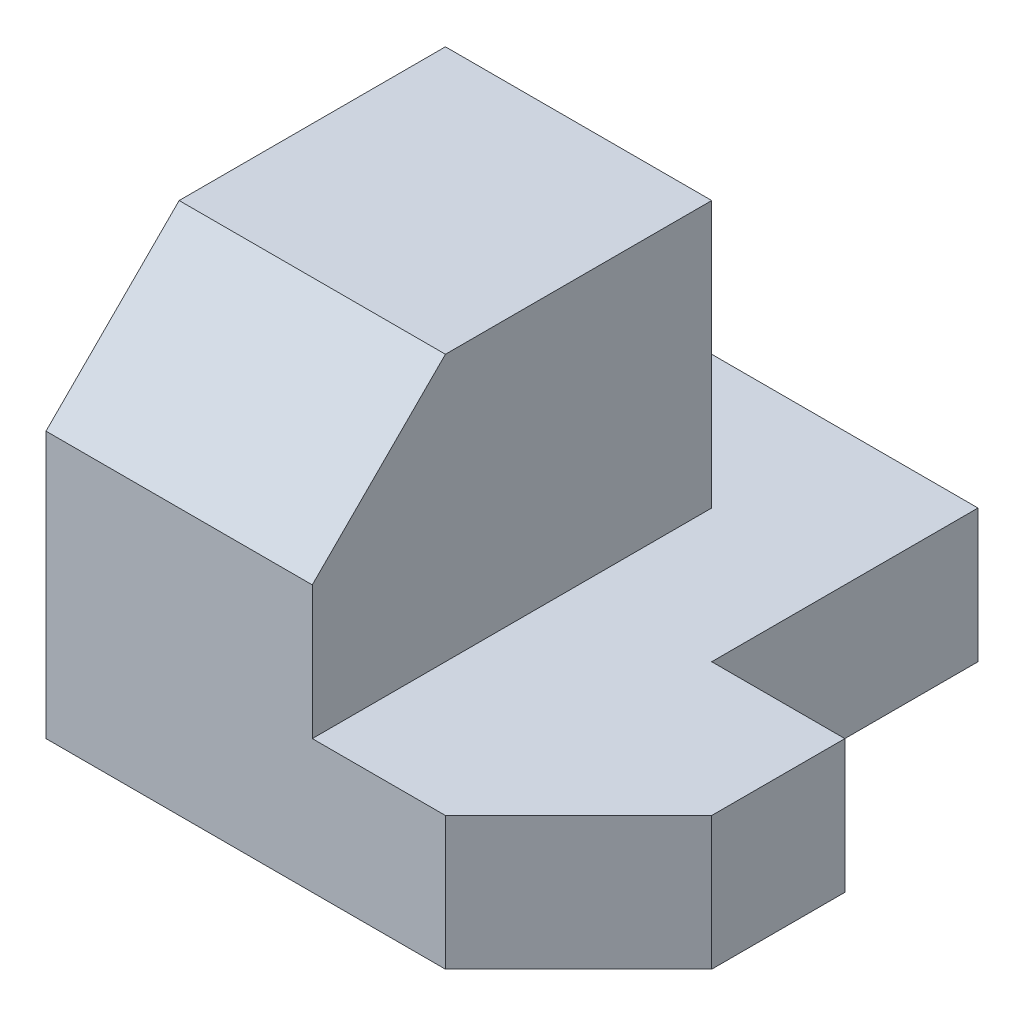
ISO-10303-21;
HEADER;
FILE_DESCRIPTION(('STEP AP214'),'2;1');
FILE_NAME('part.step','',(''),(''),'','','');
FILE_SCHEMA(('AUTOMOTIVE_DESIGN { 1 0 10303 214 1 1 1 1 }'));
ENDSEC;
DATA;
#1=APPLICATION_CONTEXT('core data for automotive mechanical design processes');
#2=APPLICATION_PROTOCOL_DEFINITION('international standard','automotive_design',2000,#1);
#3=PRODUCT_CONTEXT('',#1,'mechanical');
#4=PRODUCT('Part','Part','',(#3));
#5=PRODUCT_RELATED_PRODUCT_CATEGORY('part','',(#4));
#6=PRODUCT_DEFINITION_FORMATION('','',#4);
#7=PRODUCT_DEFINITION_CONTEXT('part definition',#1,'design');
#8=PRODUCT_DEFINITION('design','',#6,#7);
#9=PRODUCT_DEFINITION_SHAPE('','',#8);
#10=(LENGTH_UNIT() NAMED_UNIT(*) SI_UNIT(.MILLI.,.METRE.));
#11=(NAMED_UNIT(*) PLANE_ANGLE_UNIT() SI_UNIT($,.RADIAN.));
#12=(NAMED_UNIT(*) SI_UNIT($,.STERADIAN.) SOLID_ANGLE_UNIT());
#13=UNCERTAINTY_MEASURE_WITH_UNIT(LENGTH_MEASURE(1.E-05),#10,'distance_accuracy_value','');
#14=(GEOMETRIC_REPRESENTATION_CONTEXT(3) GLOBAL_UNCERTAINTY_ASSIGNED_CONTEXT((#13)) GLOBAL_UNIT_ASSIGNED_CONTEXT((#10,
#11,#12)) REPRESENTATION_CONTEXT('',''));
#15=CARTESIAN_POINT('',(0.,0.,0.));
#16=DIRECTION('',(0.,0.,1.));
#17=DIRECTION('',(1.,0.,0.));
#18=AXIS2_PLACEMENT_3D('',#15,#16,#17);
#19=CARTESIAN_POINT('',(0.,5.,0.));
#20=DIRECTION('',(-1.,0.,0.));
#21=DIRECTION('',(0.,0.,1.));
#22=AXIS2_PLACEMENT_3D('',#19,#20,#21);
#23=PLANE('',#22);
#24=DIRECTION('',(0.,-0.707106781186548,0.707106781186547));
#25=VECTOR('',#24,1.);
#26=CARTESIAN_POINT('',(0.,7.5,2.5));
#27=LINE('',#26,#25);
#28=CARTESIAN_POINT('',(0.,15.,-5.));
#29=VERTEX_POINT('',#28);
#30=CARTESIAN_POINT('',(0.,10.,0.));
#31=VERTEX_POINT('',#30);
#32=EDGE_CURVE('E118',#29,#31,#27,.T.);
#33=ORIENTED_EDGE('',*,*,#32,.F.);
#34=DIRECTION('',(0.,0.,-1.));
#35=VECTOR('',#34,1.);
#36=CARTESIAN_POINT('',(0.,15.,0.));
#37=LINE('',#36,#35);
#38=CARTESIAN_POINT('',(0.,15.,-15.));
#39=VERTEX_POINT('',#38);
#40=EDGE_CURVE('E231',#29,#39,#37,.T.);
#41=ORIENTED_EDGE('',*,*,#40,.T.);
#42=DIRECTION('',(0.,-1.,0.));
#43=VECTOR('',#42,1.);
#44=CARTESIAN_POINT('',(0.,15.,-15.));
#45=LINE('',#44,#43);
#46=CARTESIAN_POINT('',(0.,5.,-15.));
#47=VERTEX_POINT('',#46);
#48=EDGE_CURVE('E139',#39,#47,#45,.T.);
#49=ORIENTED_EDGE('',*,*,#48,.T.);
#50=DIRECTION('',(0.,0.,-1.));
#51=VECTOR('',#50,1.);
#52=CARTESIAN_POINT('',(0.,5.,0.));
#53=LINE('',#52,#51);
#54=CARTESIAN_POINT('',(0.,5.,-20.));
#55=VERTEX_POINT('',#54);
#56=EDGE_CURVE('E145',#47,#55,#53,.T.);
#57=ORIENTED_EDGE('',*,*,#56,.T.);
#58=DIRECTION('',(0.,-1.,0.));
#59=VECTOR('',#58,1.);
#60=CARTESIAN_POINT('',(0.,5.,-20.));
#61=LINE('',#60,#59);
#62=CARTESIAN_POINT('',(0.,0.,-20.));
#63=VERTEX_POINT('',#62);
#64=EDGE_CURVE('E164',#55,#63,#61,.T.);
#65=ORIENTED_EDGE('',*,*,#64,.T.);
#66=DIRECTION('',(0.,0.,-1.));
#67=VECTOR('',#66,1.);
#68=CARTESIAN_POINT('',(0.,0.,0.));
#69=LINE('',#68,#67);
#70=CARTESIAN_POINT('',(0.,0.,0.));
#71=VERTEX_POINT('',#70);
#72=EDGE_CURVE('E144',#71,#63,#69,.T.);
#73=ORIENTED_EDGE('',*,*,#72,.F.);
#74=DIRECTION('',(0.,-1.,0.));
#75=VECTOR('',#74,1.);
#76=CARTESIAN_POINT('',(0.,5.,0.));
#77=LINE('',#76,#75);
#78=EDGE_CURVE('E42',#31,#71,#77,.T.);
#79=ORIENTED_EDGE('',*,*,#78,.F.);
#80=EDGE_LOOP('',(#33,#41,#49,#57,#65,#73,#79));
#81=FACE_BOUND('',#80,.T.);
#82=ADVANCED_FACE('F35',(#81),#23,.T.);
#83=CARTESIAN_POINT('',(0.,5.,0.));
#84=DIRECTION('',(0.,0.,1.));
#85=DIRECTION('',(1.,0.,0.));
#86=AXIS2_PLACEMENT_3D('',#83,#84,#85);
#87=PLANE('',#86);
#88=DIRECTION('',(1.,0.,0.));
#89=VECTOR('',#88,1.);
#90=CARTESIAN_POINT('',(-5.,10.,0.));
#91=LINE('',#90,#89);
#92=CARTESIAN_POINT('',(10.,10.,0.));
#93=VERTEX_POINT('',#92);
#94=EDGE_CURVE('E115',#31,#93,#91,.T.);
#95=ORIENTED_EDGE('',*,*,#94,.F.);
#96=ORIENTED_EDGE('',*,*,#78,.T.);
#97=DIRECTION('',(-1.,0.,0.));
#98=VECTOR('',#97,1.);
#99=CARTESIAN_POINT('',(0.,0.,0.));
#100=LINE('',#99,#98);
#101=CARTESIAN_POINT('',(15.,0.,0.));
#102=VERTEX_POINT('',#101);
#103=EDGE_CURVE('E166',#102,#71,#100,.T.);
#104=ORIENTED_EDGE('',*,*,#103,.F.);
#105=DIRECTION('',(0.,-1.,0.));
#106=VECTOR('',#105,1.);
#107=CARTESIAN_POINT('',(15.,5.,0.));
#108=LINE('',#107,#106);
#109=CARTESIAN_POINT('',(15.,5.,0.));
#110=VERTEX_POINT('',#109);
#111=EDGE_CURVE('E193',#110,#102,#108,.T.);
#112=ORIENTED_EDGE('',*,*,#111,.F.);
#113=DIRECTION('',(-1.,0.,0.));
#114=VECTOR('',#113,1.);
#115=CARTESIAN_POINT('',(0.,5.,0.));
#116=LINE('',#115,#114);
#117=CARTESIAN_POINT('',(10.,5.,0.));
#118=VERTEX_POINT('',#117);
#119=EDGE_CURVE('E133',#110,#118,#116,.T.);
#120=ORIENTED_EDGE('',*,*,#119,.T.);
#121=DIRECTION('',(0.,-1.,0.));
#122=VECTOR('',#121,1.);
#123=CARTESIAN_POINT('',(10.,15.,0.));
#124=LINE('',#123,#122);
#125=EDGE_CURVE('E126',#93,#118,#124,.T.);
#126=ORIENTED_EDGE('',*,*,#125,.F.);
#127=EDGE_LOOP('',(#95,#96,#104,#112,#120,#126));
#128=FACE_BOUND('',#127,.T.);
#129=ADVANCED_FACE('F131',(#128),#87,.T.);
#130=CARTESIAN_POINT('',(7.5,5.,7.5));
#131=DIRECTION('',(0.707106781186548,0.,0.707106781186548));
#132=DIRECTION('',(0.707106781186548,0.,-0.707106781186548));
#133=AXIS2_PLACEMENT_3D('',#130,#131,#132);
#134=PLANE('',#133);
#135=DIRECTION('',(-0.707106781186548,0.,0.707106781186548));
#136=VECTOR('',#135,1.);
#137=CARTESIAN_POINT('',(7.5,0.,7.5));
#138=LINE('',#137,#136);
#139=CARTESIAN_POINT('',(20.,0.,-5.));
#140=VERTEX_POINT('',#139);
#141=EDGE_CURVE('E169',#140,#102,#138,.T.);
#142=ORIENTED_EDGE('',*,*,#141,.F.);
#143=DIRECTION('',(0.,-1.,0.));
#144=VECTOR('',#143,1.);
#145=CARTESIAN_POINT('',(20.,5.,-5.));
#146=LINE('',#145,#144);
#147=CARTESIAN_POINT('',(20.,5.,-5.));
#148=VERTEX_POINT('',#147);
#149=EDGE_CURVE('E191',#148,#140,#146,.T.);
#150=ORIENTED_EDGE('',*,*,#149,.F.);
#151=DIRECTION('',(-0.707106781186548,0.,0.707106781186548));
#152=VECTOR('',#151,1.);
#153=CARTESIAN_POINT('',(7.5,5.,7.5));
#154=LINE('',#153,#152);
#155=EDGE_CURVE('E149',#148,#110,#154,.T.);
#156=ORIENTED_EDGE('',*,*,#155,.T.);
#157=ORIENTED_EDGE('',*,*,#111,.T.);
#158=EDGE_LOOP('',(#142,#150,#156,#157));
#159=FACE_BOUND('',#158,.T.);
#160=ADVANCED_FACE('F220',(#159),#134,.T.);
#161=CARTESIAN_POINT('',(20.,5.,0.));
#162=DIRECTION('',(1.,0.,0.));
#163=DIRECTION('',(0.,0.,-1.));
#164=AXIS2_PLACEMENT_3D('',#161,#162,#163);
#165=PLANE('',#164);
#166=DIRECTION('',(0.,0.,1.));
#167=VECTOR('',#166,1.);
#168=CARTESIAN_POINT('',(20.,0.,0.));
#169=LINE('',#168,#167);
#170=CARTESIAN_POINT('',(20.,0.,-10.));
#171=VERTEX_POINT('',#170);
#172=EDGE_CURVE('E172',#171,#140,#169,.T.);
#173=ORIENTED_EDGE('',*,*,#172,.F.);
#174=DIRECTION('',(0.,-1.,0.));
#175=VECTOR('',#174,1.);
#176=CARTESIAN_POINT('',(20.,5.,-10.));
#177=LINE('',#176,#175);
#178=CARTESIAN_POINT('',(20.,5.,-10.));
#179=VERTEX_POINT('',#178);
#180=EDGE_CURVE('E189',#179,#171,#177,.T.);
#181=ORIENTED_EDGE('',*,*,#180,.F.);
#182=DIRECTION('',(0.,0.,1.));
#183=VECTOR('',#182,1.);
#184=CARTESIAN_POINT('',(20.,5.,0.));
#185=LINE('',#184,#183);
#186=EDGE_CURVE('E152',#179,#148,#185,.T.);
#187=ORIENTED_EDGE('',*,*,#186,.T.);
#188=ORIENTED_EDGE('',*,*,#149,.T.);
#189=EDGE_LOOP('',(#173,#181,#187,#188));
#190=FACE_BOUND('',#189,.T.);
#191=ADVANCED_FACE('F217',(#190),#165,.T.);
#192=CARTESIAN_POINT('',(0.,5.,-10.));
#193=DIRECTION('',(0.,0.,-1.));
#194=DIRECTION('',(-1.,0.,0.));
#195=AXIS2_PLACEMENT_3D('',#192,#193,#194);
#196=PLANE('',#195);
#197=DIRECTION('',(1.,0.,0.));
#198=VECTOR('',#197,1.);
#199=CARTESIAN_POINT('',(0.,0.,-10.));
#200=LINE('',#199,#198);
#201=CARTESIAN_POINT('',(15.,0.,-10.));
#202=VERTEX_POINT('',#201);
#203=EDGE_CURVE('E175',#202,#171,#200,.T.);
#204=ORIENTED_EDGE('',*,*,#203,.F.);
#205=DIRECTION('',(0.,-1.,0.));
#206=VECTOR('',#205,1.);
#207=CARTESIAN_POINT('',(15.,5.,-10.));
#208=LINE('',#207,#206);
#209=CARTESIAN_POINT('',(15.,5.,-10.));
#210=VERTEX_POINT('',#209);
#211=EDGE_CURVE('E187',#210,#202,#208,.T.);
#212=ORIENTED_EDGE('',*,*,#211,.F.);
#213=DIRECTION('',(1.,0.,0.));
#214=VECTOR('',#213,1.);
#215=CARTESIAN_POINT('',(0.,5.,-10.));
#216=LINE('',#215,#214);
#217=EDGE_CURVE('E155',#210,#179,#216,.T.);
#218=ORIENTED_EDGE('',*,*,#217,.T.);
#219=ORIENTED_EDGE('',*,*,#180,.T.);
#220=EDGE_LOOP('',(#204,#212,#218,#219));
#221=FACE_BOUND('',#220,.T.);
#222=ADVANCED_FACE('F213',(#221),#196,.T.);
#223=CARTESIAN_POINT('',(15.,5.,0.));
#224=DIRECTION('',(1.,0.,0.));
#225=DIRECTION('',(0.,0.,-1.));
#226=AXIS2_PLACEMENT_3D('',#223,#224,#225);
#227=PLANE('',#226);
#228=DIRECTION('',(0.,0.,1.));
#229=VECTOR('',#228,1.);
#230=CARTESIAN_POINT('',(15.,0.,0.));
#231=LINE('',#230,#229);
#232=CARTESIAN_POINT('',(15.,0.,-20.));
#233=VERTEX_POINT('',#232);
#234=EDGE_CURVE('E178',#233,#202,#231,.T.);
#235=ORIENTED_EDGE('',*,*,#234,.F.);
#236=DIRECTION('',(0.,-1.,0.));
#237=VECTOR('',#236,1.);
#238=CARTESIAN_POINT('',(15.,5.,-20.));
#239=LINE('',#238,#237);
#240=CARTESIAN_POINT('',(15.,5.,-20.));
#241=VERTEX_POINT('',#240);
#242=EDGE_CURVE('E185',#241,#233,#239,.T.);
#243=ORIENTED_EDGE('',*,*,#242,.F.);
#244=DIRECTION('',(0.,0.,1.));
#245=VECTOR('',#244,1.);
#246=CARTESIAN_POINT('',(15.,5.,0.));
#247=LINE('',#246,#245);
#248=EDGE_CURVE('E158',#241,#210,#247,.T.);
#249=ORIENTED_EDGE('',*,*,#248,.T.);
#250=ORIENTED_EDGE('',*,*,#211,.T.);
#251=EDGE_LOOP('',(#235,#243,#249,#250));
#252=FACE_BOUND('',#251,.T.);
#253=ADVANCED_FACE('F209',(#252),#227,.T.);
#254=CARTESIAN_POINT('',(0.,5.,-20.));
#255=DIRECTION('',(0.,0.,-1.));
#256=DIRECTION('',(-1.,0.,0.));
#257=AXIS2_PLACEMENT_3D('',#254,#255,#256);
#258=PLANE('',#257);
#259=DIRECTION('',(1.,0.,0.));
#260=VECTOR('',#259,1.);
#261=CARTESIAN_POINT('',(0.,0.,-20.));
#262=LINE('',#261,#260);
#263=EDGE_CURVE('E147',#63,#233,#262,.T.);
#264=ORIENTED_EDGE('',*,*,#263,.F.);
#265=ORIENTED_EDGE('',*,*,#64,.F.);
#266=DIRECTION('',(1.,0.,0.));
#267=VECTOR('',#266,1.);
#268=CARTESIAN_POINT('',(0.,5.,-20.));
#269=LINE('',#268,#267);
#270=EDGE_CURVE('E161',#55,#241,#269,.T.);
#271=ORIENTED_EDGE('',*,*,#270,.T.);
#272=ORIENTED_EDGE('',*,*,#242,.T.);
#273=EDGE_LOOP('',(#264,#265,#271,#272));
#274=FACE_BOUND('',#273,.T.);
#275=ADVANCED_FACE('F205',(#274),#258,.T.);
#276=CARTESIAN_POINT('',(0.,5.,0.));
#277=DIRECTION('',(0.,1.,0.));
#278=DIRECTION('',(0.,0.,1.));
#279=AXIS2_PLACEMENT_3D('',#276,#277,#278);
#280=PLANE('',#279);
#281=DIRECTION('',(0.,0.,-1.));
#282=VECTOR('',#281,1.);
#283=CARTESIAN_POINT('',(10.,5.,0.));
#284=LINE('',#283,#282);
#285=CARTESIAN_POINT('',(10.,5.,-15.));
#286=VERTEX_POINT('',#285);
#287=EDGE_CURVE('E136',#118,#286,#284,.T.);
#288=ORIENTED_EDGE('',*,*,#287,.F.);
#289=ORIENTED_EDGE('',*,*,#119,.F.);
#290=ORIENTED_EDGE('',*,*,#155,.F.);
#291=ORIENTED_EDGE('',*,*,#186,.F.);
#292=ORIENTED_EDGE('',*,*,#217,.F.);
#293=ORIENTED_EDGE('',*,*,#248,.F.);
#294=ORIENTED_EDGE('',*,*,#270,.F.);
#295=ORIENTED_EDGE('',*,*,#56,.F.);
#296=DIRECTION('',(-1.,0.,0.));
#297=VECTOR('',#296,1.);
#298=CARTESIAN_POINT('',(0.,5.,-15.));
#299=LINE('',#298,#297);
#300=EDGE_CURVE('E56',#286,#47,#299,.T.);
#301=ORIENTED_EDGE('',*,*,#300,.F.);
#302=EDGE_LOOP('',(#288,#289,#290,#291,#292,#293,#294,#295,#301));
#303=FACE_BOUND('',#302,.T.);
#304=ADVANCED_FACE('F221',(#303),#280,.T.);
#305=CARTESIAN_POINT('',(0.,0.,0.));
#306=DIRECTION('',(0.,1.,0.));
#307=DIRECTION('',(0.,0.,1.));
#308=AXIS2_PLACEMENT_3D('',#305,#306,#307);
#309=PLANE('',#308);
#310=ORIENTED_EDGE('',*,*,#103,.T.);
#311=ORIENTED_EDGE('',*,*,#72,.T.);
#312=ORIENTED_EDGE('',*,*,#263,.T.);
#313=ORIENTED_EDGE('',*,*,#234,.T.);
#314=ORIENTED_EDGE('',*,*,#203,.T.);
#315=ORIENTED_EDGE('',*,*,#172,.T.);
#316=ORIENTED_EDGE('',*,*,#141,.T.);
#317=EDGE_LOOP('',(#310,#311,#312,#313,#314,#315,#316));
#318=FACE_BOUND('',#317,.T.);
#319=ADVANCED_FACE('F198',(#318),#309,.F.);
#320=CARTESIAN_POINT('',(10.,15.,0.));
#321=DIRECTION('',(1.,0.,0.));
#322=DIRECTION('',(0.,0.,-1.));
#323=AXIS2_PLACEMENT_3D('',#320,#321,#322);
#324=PLANE('',#323);
#325=DIRECTION('',(0.,0.707106781186548,-0.707106781186547));
#326=VECTOR('',#325,1.);
#327=CARTESIAN_POINT('',(10.,10.,0.));
#328=LINE('',#327,#326);
#329=CARTESIAN_POINT('',(10.,15.,-5.));
#330=VERTEX_POINT('',#329);
#331=EDGE_CURVE('E48',#93,#330,#328,.T.);
#332=ORIENTED_EDGE('',*,*,#331,.F.);
#333=ORIENTED_EDGE('',*,*,#125,.T.);
#334=ORIENTED_EDGE('',*,*,#287,.T.);
#335=DIRECTION('',(0.,-1.,0.));
#336=VECTOR('',#335,1.);
#337=CARTESIAN_POINT('',(10.,15.,-15.));
#338=LINE('',#337,#336);
#339=CARTESIAN_POINT('',(10.,15.,-15.));
#340=VERTEX_POINT('',#339);
#341=EDGE_CURVE('E134',#340,#286,#338,.T.);
#342=ORIENTED_EDGE('',*,*,#341,.F.);
#343=DIRECTION('',(0.,0.,1.));
#344=VECTOR('',#343,1.);
#345=CARTESIAN_POINT('',(10.,15.,0.));
#346=LINE('',#345,#344);
#347=EDGE_CURVE('E128',#340,#330,#346,.T.);
#348=ORIENTED_EDGE('',*,*,#347,.T.);
#349=EDGE_LOOP('',(#332,#333,#334,#342,#348));
#350=FACE_BOUND('',#349,.T.);
#351=ADVANCED_FACE('F125',(#350),#324,.T.);
#352=CARTESIAN_POINT('',(0.,15.,-15.));
#353=DIRECTION('',(0.,0.,-1.));
#354=DIRECTION('',(-1.,0.,0.));
#355=AXIS2_PLACEMENT_3D('',#352,#353,#354);
#356=PLANE('',#355);
#357=ORIENTED_EDGE('',*,*,#341,.T.);
#358=ORIENTED_EDGE('',*,*,#300,.T.);
#359=ORIENTED_EDGE('',*,*,#48,.F.);
#360=DIRECTION('',(1.,0.,0.));
#361=VECTOR('',#360,1.);
#362=CARTESIAN_POINT('',(0.,15.,-15.));
#363=LINE('',#362,#361);
#364=EDGE_CURVE('E227',#39,#340,#363,.T.);
#365=ORIENTED_EDGE('',*,*,#364,.T.);
#366=EDGE_LOOP('',(#357,#358,#359,#365));
#367=FACE_BOUND('',#366,.T.);
#368=ADVANCED_FACE('F224',(#367),#356,.T.);
#369=CARTESIAN_POINT('',(0.,15.,0.));
#370=DIRECTION('',(0.,1.,0.));
#371=DIRECTION('',(0.,0.,1.));
#372=AXIS2_PLACEMENT_3D('',#369,#370,#371);
#373=PLANE('',#372);
#374=DIRECTION('',(-1.,0.,0.));
#375=VECTOR('',#374,1.);
#376=CARTESIAN_POINT('',(0.,15.,-5.));
#377=LINE('',#376,#375);
#378=EDGE_CURVE('E11',#330,#29,#377,.T.);
#379=ORIENTED_EDGE('',*,*,#378,.F.);
#380=ORIENTED_EDGE('',*,*,#347,.F.);
#381=ORIENTED_EDGE('',*,*,#364,.F.);
#382=ORIENTED_EDGE('',*,*,#40,.F.);
#383=EDGE_LOOP('',(#379,#380,#381,#382));
#384=FACE_BOUND('',#383,.T.);
#385=ADVANCED_FACE('F235',(#384),#373,.T.);
#386=CARTESIAN_POINT('',(-5.,10.,0.));
#387=DIRECTION('',(0.,-0.707106781186547,-0.707106781186548));
#388=DIRECTION('',(0.,0.707106781186548,-0.707106781186547));
#389=AXIS2_PLACEMENT_3D('',#386,#387,#388);
#390=PLANE('',#389);
#391=ORIENTED_EDGE('',*,*,#32,.T.);
#392=ORIENTED_EDGE('',*,*,#94,.T.);
#393=ORIENTED_EDGE('',*,*,#331,.T.);
#394=ORIENTED_EDGE('',*,*,#378,.T.);
#395=EDGE_LOOP('',(#391,#392,#393,#394));
#396=FACE_BOUND('',#395,.T.);
#397=ADVANCED_FACE('F116',(#396),#390,.F.);
#398=CLOSED_SHELL('',(#82,#129,#160,#191,#222,#253,#275,#304,#319,#351,#368,#385,#397));
#399=MANIFOLD_SOLID_BREP('B2',#398);
#400=ADVANCED_BREP_SHAPE_REPRESENTATION('',(#18,#399),#14);
#401=SHAPE_DEFINITION_REPRESENTATION(#9,#400);
ENDSEC;
END-ISO-10303-21;
